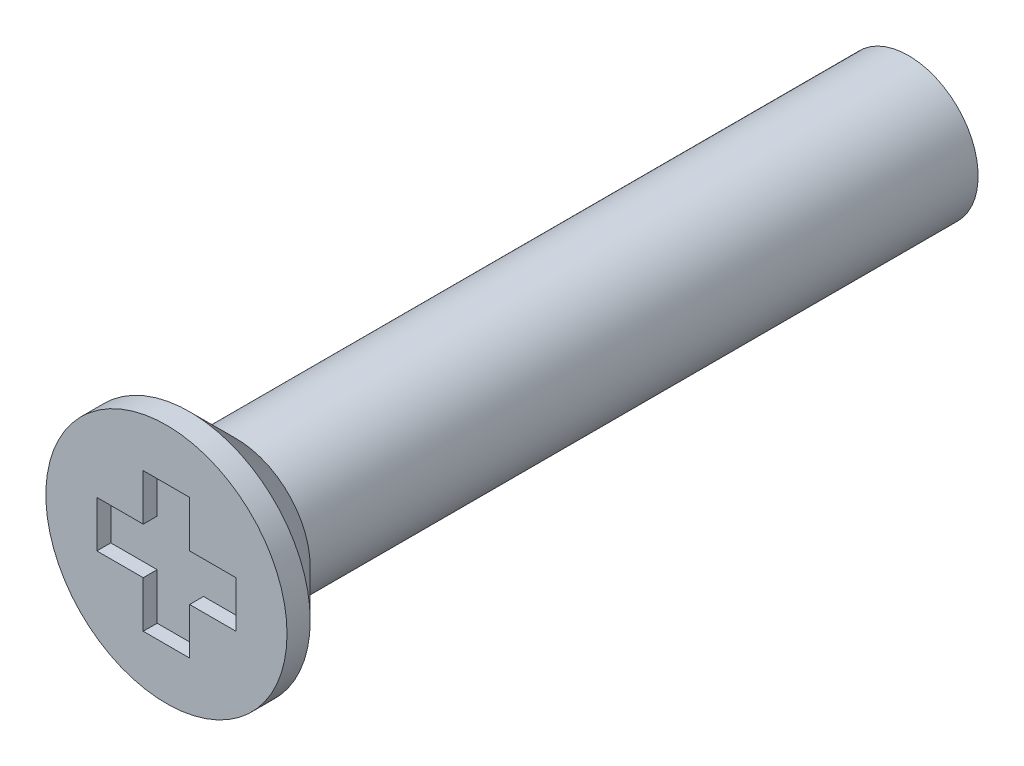
ISO-10303-21;
HEADER;
FILE_DESCRIPTION(('STEP AP214'),'2;1');
FILE_NAME('part.step','',(''),(''),'','','');
FILE_SCHEMA(('AUTOMOTIVE_DESIGN { 1 0 10303 214 1 1 1 1 }'));
ENDSEC;
DATA;
#1=APPLICATION_CONTEXT('core data for automotive mechanical design processes');
#2=APPLICATION_PROTOCOL_DEFINITION('international standard','automotive_design',2000,#1);
#3=PRODUCT_CONTEXT('',#1,'mechanical');
#4=PRODUCT('Part','Part','',(#3));
#5=PRODUCT_RELATED_PRODUCT_CATEGORY('part','',(#4));
#6=PRODUCT_DEFINITION_FORMATION('','',#4);
#7=PRODUCT_DEFINITION_CONTEXT('part definition',#1,'design');
#8=PRODUCT_DEFINITION('design','',#6,#7);
#9=PRODUCT_DEFINITION_SHAPE('','',#8);
#10=(LENGTH_UNIT() NAMED_UNIT(*) SI_UNIT(.MILLI.,.METRE.));
#11=(NAMED_UNIT(*) PLANE_ANGLE_UNIT() SI_UNIT($,.RADIAN.));
#12=(NAMED_UNIT(*) SI_UNIT($,.STERADIAN.) SOLID_ANGLE_UNIT());
#13=UNCERTAINTY_MEASURE_WITH_UNIT(LENGTH_MEASURE(1.E-05),#10,'distance_accuracy_value','');
#14=(GEOMETRIC_REPRESENTATION_CONTEXT(3) GLOBAL_UNCERTAINTY_ASSIGNED_CONTEXT((#13)) GLOBAL_UNIT_ASSIGNED_CONTEXT((#10,
#11,#12)) REPRESENTATION_CONTEXT('',''));
#15=CARTESIAN_POINT('',(0.,0.,0.));
#16=DIRECTION('',(0.,0.,1.));
#17=DIRECTION('',(1.,0.,0.));
#18=AXIS2_PLACEMENT_3D('',#15,#16,#17);
#19=CARTESIAN_POINT('',(0.,0.,10.));
#20=DIRECTION('',(0.,0.,1.));
#21=DIRECTION('',(1.,0.,0.));
#22=AXIS2_PLACEMENT_3D('',#19,#20,#21);
#23=PLANE('',#22);
#24=DIRECTION('',(0.,-1.,0.));
#25=VECTOR('',#24,1.);
#26=CARTESIAN_POINT('',(0.499999988824129,-0.249999994412065,10.));
#27=LINE('',#26,#25);
#28=CARTESIAN_POINT('',(0.499999988824129,-0.499999988824129,10.));
#29=VERTEX_POINT('',#28);
#30=CARTESIAN_POINT('',(0.499999988824129,-1.49999996647239,10.));
#31=VERTEX_POINT('',#30);
#32=EDGE_CURVE('E138',#29,#31,#27,.T.);
#33=ORIENTED_EDGE('',*,*,#32,.T.);
#34=DIRECTION('',(-1.,0.,0.));
#35=VECTOR('',#34,1.);
#36=CARTESIAN_POINT('',(0.249999994412065,-1.49999996647239,10.));
#37=LINE('',#36,#35);
#38=CARTESIAN_POINT('',(-0.499999988824129,-1.49999996647239,10.));
#39=VERTEX_POINT('',#38);
#40=EDGE_CURVE('E223',#31,#39,#37,.T.);
#41=ORIENTED_EDGE('',*,*,#40,.T.);
#42=DIRECTION('',(0.,1.,0.));
#43=VECTOR('',#42,1.);
#44=CARTESIAN_POINT('',(-0.499999988824129,-0.749999983236194,10.));
#45=LINE('',#44,#43);
#46=CARTESIAN_POINT('',(-0.499999988824129,-0.499999988824129,10.));
#47=VERTEX_POINT('',#46);
#48=EDGE_CURVE('E266',#39,#47,#45,.T.);
#49=ORIENTED_EDGE('',*,*,#48,.T.);
#50=DIRECTION('',(-1.,0.,0.));
#51=VECTOR('',#50,1.);
#52=CARTESIAN_POINT('',(-0.249999994412065,-0.499999988824129,10.));
#53=LINE('',#52,#51);
#54=CARTESIAN_POINT('',(-1.49999996647239,-0.499999988824129,10.));
#55=VERTEX_POINT('',#54);
#56=EDGE_CURVE('E161',#47,#55,#53,.T.);
#57=ORIENTED_EDGE('',*,*,#56,.T.);
#58=DIRECTION('',(0.,1.,0.));
#59=VECTOR('',#58,1.);
#60=CARTESIAN_POINT('',(-1.49999996647239,-0.249999994412065,10.));
#61=LINE('',#60,#59);
#62=CARTESIAN_POINT('',(-1.49999996647239,0.499999988824129,10.));
#63=VERTEX_POINT('',#62);
#64=EDGE_CURVE('E21',#55,#63,#61,.T.);
#65=ORIENTED_EDGE('',*,*,#64,.T.);
#66=DIRECTION('',(1.,0.,0.));
#67=VECTOR('',#66,1.);
#68=CARTESIAN_POINT('',(-0.749999983236194,0.499999988824129,10.));
#69=LINE('',#68,#67);
#70=CARTESIAN_POINT('',(-0.499999988824129,0.499999988824129,10.));
#71=VERTEX_POINT('',#70);
#72=EDGE_CURVE('E270',#63,#71,#69,.T.);
#73=ORIENTED_EDGE('',*,*,#72,.T.);
#74=DIRECTION('',(0.,1.,0.));
#75=VECTOR('',#74,1.);
#76=CARTESIAN_POINT('',(-0.499999988824129,0.249999994412065,10.));
#77=LINE('',#76,#75);
#78=CARTESIAN_POINT('',(-0.499999988824129,1.49999996647239,10.));
#79=VERTEX_POINT('',#78);
#80=EDGE_CURVE('E162',#71,#79,#77,.T.);
#81=ORIENTED_EDGE('',*,*,#80,.T.);
#82=DIRECTION('',(1.,0.,0.));
#83=VECTOR('',#82,1.);
#84=CARTESIAN_POINT('',(-0.249999994412065,1.49999996647239,10.));
#85=LINE('',#84,#83);
#86=CARTESIAN_POINT('',(0.499999988824129,1.49999996647239,10.));
#87=VERTEX_POINT('',#86);
#88=EDGE_CURVE('E222',#79,#87,#85,.T.);
#89=ORIENTED_EDGE('',*,*,#88,.T.);
#90=DIRECTION('',(0.,-1.,0.));
#91=VECTOR('',#90,1.);
#92=CARTESIAN_POINT('',(0.499999988824129,0.749999983236194,10.));
#93=LINE('',#92,#91);
#94=CARTESIAN_POINT('',(0.499999988824129,0.499999988824129,10.));
#95=VERTEX_POINT('',#94);
#96=EDGE_CURVE('E177',#87,#95,#93,.T.);
#97=ORIENTED_EDGE('',*,*,#96,.T.);
#98=DIRECTION('',(1.,0.,0.));
#99=VECTOR('',#98,1.);
#100=CARTESIAN_POINT('',(0.249999994412065,0.499999988824129,10.));
#101=LINE('',#100,#99);
#102=CARTESIAN_POINT('',(1.49999996647239,0.499999988824129,10.));
#103=VERTEX_POINT('',#102);
#104=EDGE_CURVE('E170',#95,#103,#101,.T.);
#105=ORIENTED_EDGE('',*,*,#104,.T.);
#106=DIRECTION('',(0.,-1.,0.));
#107=VECTOR('',#106,1.);
#108=CARTESIAN_POINT('',(1.49999996647239,0.249999994412065,10.));
#109=LINE('',#108,#107);
#110=CARTESIAN_POINT('',(1.49999996647239,-0.499999988824129,10.));
#111=VERTEX_POINT('',#110);
#112=EDGE_CURVE('E278',#103,#111,#109,.T.);
#113=ORIENTED_EDGE('',*,*,#112,.T.);
#114=DIRECTION('',(-1.,0.,0.));
#115=VECTOR('',#114,1.);
#116=CARTESIAN_POINT('',(0.749999983236194,-0.499999988824129,10.));
#117=LINE('',#116,#115);
#118=EDGE_CURVE('E178',#111,#29,#117,.T.);
#119=ORIENTED_EDGE('',*,*,#118,.T.);
#120=EDGE_LOOP('',(#33,#41,#49,#57,#65,#73,#81,#89,#97,#105,#113,#119));
#121=FACE_BOUND('',#120,.T.);
#122=CARTESIAN_POINT('',(0.,0.,10.));
#123=DIRECTION('',(0.,0.,1.));
#124=DIRECTION('',(-1.,0.,0.));
#125=AXIS2_PLACEMENT_3D('',#122,#123,#124);
#126=CIRCLE('',#125,2.6);
#127=CARTESIAN_POINT('',(2.6,0.,10.));
#128=VERTEX_POINT('',#127);
#129=EDGE_CURVE('E204',#128,#128,#126,.T.);
#130=ORIENTED_EDGE('',*,*,#129,.T.);
#131=EDGE_LOOP('',(#130));
#132=FACE_BOUND('',#131,.T.);
#133=ADVANCED_FACE('F17',(#121,#132),#23,.T.);
#134=CARTESIAN_POINT('',(0.,0.,0.));
#135=DIRECTION('',(0.,0.,1.));
#136=DIRECTION('',(1.,0.,0.));
#137=AXIS2_PLACEMENT_3D('',#134,#135,#136);
#138=CYLINDRICAL_SURFACE('',#137,1.5);
#139=CARTESIAN_POINT('',(0.,0.,8.5));
#140=DIRECTION('',(0.,0.,-1.));
#141=DIRECTION('',(1.,0.,0.));
#142=AXIS2_PLACEMENT_3D('',#139,#140,#141);
#143=CIRCLE('',#142,1.5);
#144=CARTESIAN_POINT('',(-1.5,0.,8.5));
#145=VERTEX_POINT('',#144);
#146=EDGE_CURVE('E28',#145,#145,#143,.T.);
#147=ORIENTED_EDGE('',*,*,#146,.T.);
#148=DIRECTION('',(0.,0.,-1.));
#149=VECTOR('',#148,1.);
#150=CARTESIAN_POINT('',(-1.5,0.,0.));
#151=LINE('',#150,#149);
#152=CARTESIAN_POINT('',(-1.5,0.,-6.));
#153=VERTEX_POINT('',#152);
#154=EDGE_CURVE('E11',#145,#153,#151,.T.);
#155=ORIENTED_EDGE('',*,*,#154,.T.);
#156=CARTESIAN_POINT('',(0.,0.,-6.));
#157=DIRECTION('',(0.,0.,-1.));
#158=DIRECTION('',(1.,0.,0.));
#159=AXIS2_PLACEMENT_3D('',#156,#157,#158);
#160=CIRCLE('',#159,1.5);
#161=EDGE_CURVE('E133',#153,#153,#160,.T.);
#162=ORIENTED_EDGE('',*,*,#161,.F.);
#163=ORIENTED_EDGE('',*,*,#154,.F.);
#164=EDGE_LOOP('',(#147,#155,#162,#163));
#165=FACE_BOUND('',#164,.T.);
#166=ADVANCED_FACE('F132',(#165),#138,.T.);
#167=CARTESIAN_POINT('',(0.,0.,8.5));
#168=DIRECTION('',(0.,0.,1.));
#169=DIRECTION('',(1.,0.,0.));
#170=AXIS2_PLACEMENT_3D('',#167,#168,#169);
#171=PLANE('',#170);
#172=ORIENTED_EDGE('',*,*,#146,.F.);
#173=EDGE_LOOP('',(#172));
#174=FACE_BOUND('',#173,.T.);
#175=CARTESIAN_POINT('',(0.,0.,8.5));
#176=DIRECTION('',(0.,0.,1.));
#177=DIRECTION('',(-1.,0.,0.));
#178=AXIS2_PLACEMENT_3D('',#175,#176,#177);
#179=CIRCLE('',#178,1.6);
#180=CARTESIAN_POINT('',(1.6,0.,8.5));
#181=VERTEX_POINT('',#180);
#182=EDGE_CURVE('E247',#181,#181,#179,.T.);
#183=ORIENTED_EDGE('',*,*,#182,.F.);
#184=EDGE_LOOP('',(#183));
#185=FACE_BOUND('',#184,.T.);
#186=ADVANCED_FACE('F368',(#174,#185),#171,.F.);
#187=CARTESIAN_POINT('',(0.,0.,10.));
#188=DIRECTION('',(0.,0.,-1.));
#189=DIRECTION('',(-1.,0.,0.));
#190=AXIS2_PLACEMENT_3D('',#187,#188,#189);
#191=CYLINDRICAL_SURFACE('',#190,2.6);
#192=CARTESIAN_POINT('',(0.,0.,9.5));
#193=DIRECTION('',(0.,0.,-1.));
#194=DIRECTION('',(-1.,0.,0.));
#195=AXIS2_PLACEMENT_3D('',#192,#193,#194);
#196=CIRCLE('',#195,2.6);
#197=CARTESIAN_POINT('',(2.6,0.,9.5));
#198=VERTEX_POINT('',#197);
#199=EDGE_CURVE('E255',#198,#198,#196,.T.);
#200=ORIENTED_EDGE('',*,*,#199,.F.);
#201=DIRECTION('',(0.,0.,1.));
#202=VECTOR('',#201,1.);
#203=CARTESIAN_POINT('',(2.6,0.,10.));
#204=LINE('',#203,#202);
#205=EDGE_CURVE('E259',#198,#128,#204,.T.);
#206=ORIENTED_EDGE('',*,*,#205,.T.);
#207=ORIENTED_EDGE('',*,*,#129,.F.);
#208=ORIENTED_EDGE('',*,*,#205,.F.);
#209=EDGE_LOOP('',(#200,#206,#207,#208));
#210=FACE_BOUND('',#209,.T.);
#211=ADVANCED_FACE('F363',(#210),#191,.T.);
#212=CARTESIAN_POINT('',(0.,0.,9.));
#213=DIRECTION('',(0.,0.,1.));
#214=DIRECTION('',(-1.,0.,0.));
#215=AXIS2_PLACEMENT_3D('',#212,#213,#214);
#216=CONICAL_SURFACE('',#215,2.1,0.785398163397448);
#217=ORIENTED_EDGE('',*,*,#182,.T.);
#218=DIRECTION('',(0.707106781186548,0.,0.707106781186547));
#219=VECTOR('',#218,1.);
#220=CARTESIAN_POINT('',(2.1,0.,9.));
#221=LINE('',#220,#219);
#222=EDGE_CURVE('E251',#181,#198,#221,.T.);
#223=ORIENTED_EDGE('',*,*,#222,.T.);
#224=ORIENTED_EDGE('',*,*,#199,.T.);
#225=ORIENTED_EDGE('',*,*,#222,.F.);
#226=EDGE_LOOP('',(#217,#223,#224,#225));
#227=FACE_BOUND('',#226,.T.);
#228=ADVANCED_FACE('F365',(#227),#216,.T.);
#229=CARTESIAN_POINT('',(0.,0.,9.7));
#230=DIRECTION('',(0.,0.,-1.));
#231=DIRECTION('',(0.,-1.,0.));
#232=AXIS2_PLACEMENT_3D('',#229,#230,#231);
#233=PLANE('',#232);
#234=DIRECTION('',(-1.,0.,0.));
#235=VECTOR('',#234,1.);
#236=CARTESIAN_POINT('',(0.499999988824129,-1.49999996647239,9.7));
#237=LINE('',#236,#235);
#238=CARTESIAN_POINT('',(0.499999988824129,-1.49999996647239,9.7));
#239=VERTEX_POINT('',#238);
#240=CARTESIAN_POINT('',(-0.499999988824129,-1.49999996647239,9.7));
#241=VERTEX_POINT('',#240);
#242=EDGE_CURVE('E225',#239,#241,#237,.T.);
#243=ORIENTED_EDGE('',*,*,#242,.F.);
#244=DIRECTION('',(0.,-1.,0.));
#245=VECTOR('',#244,1.);
#246=CARTESIAN_POINT('',(0.499999988824129,1.49999996647239,9.7));
#247=LINE('',#246,#245);
#248=CARTESIAN_POINT('',(0.499999988824129,-0.499999988824129,9.7));
#249=VERTEX_POINT('',#248);
#250=EDGE_CURVE('E210',#249,#239,#247,.T.);
#251=ORIENTED_EDGE('',*,*,#250,.F.);
#252=DIRECTION('',(-1.,0.,0.));
#253=VECTOR('',#252,1.);
#254=CARTESIAN_POINT('',(1.49999996647239,-0.499999988824129,9.7));
#255=LINE('',#254,#253);
#256=CARTESIAN_POINT('',(1.49999996647239,-0.499999988824129,9.7));
#257=VERTEX_POINT('',#256);
#258=EDGE_CURVE('E217',#257,#249,#255,.T.);
#259=ORIENTED_EDGE('',*,*,#258,.F.);
#260=DIRECTION('',(0.,-1.,0.));
#261=VECTOR('',#260,1.);
#262=CARTESIAN_POINT('',(1.49999996647239,0.499999988824129,9.7));
#263=LINE('',#262,#261);
#264=CARTESIAN_POINT('',(1.49999996647239,0.499999988824129,9.7));
#265=VERTEX_POINT('',#264);
#266=EDGE_CURVE('E167',#265,#257,#263,.T.);
#267=ORIENTED_EDGE('',*,*,#266,.F.);
#268=DIRECTION('',(1.,0.,0.));
#269=VECTOR('',#268,1.);
#270=CARTESIAN_POINT('',(-1.49999996647239,0.499999988824129,9.7));
#271=LINE('',#270,#269);
#272=CARTESIAN_POINT('',(0.499999988824129,0.499999988824129,9.7));
#273=VERTEX_POINT('',#272);
#274=EDGE_CURVE('E209',#273,#265,#271,.T.);
#275=ORIENTED_EDGE('',*,*,#274,.F.);
#276=DIRECTION('',(0.,-1.,0.));
#277=VECTOR('',#276,1.);
#278=CARTESIAN_POINT('',(0.499999988824129,1.49999996647239,9.7));
#279=LINE('',#278,#277);
#280=CARTESIAN_POINT('',(0.499999988824129,1.49999996647239,9.7));
#281=VERTEX_POINT('',#280);
#282=EDGE_CURVE('E176',#281,#273,#279,.T.);
#283=ORIENTED_EDGE('',*,*,#282,.F.);
#284=DIRECTION('',(1.,0.,0.));
#285=VECTOR('',#284,1.);
#286=CARTESIAN_POINT('',(-0.499999988824129,1.49999996647239,9.7));
#287=LINE('',#286,#285);
#288=CARTESIAN_POINT('',(-0.499999988824129,1.49999996647239,9.7));
#289=VERTEX_POINT('',#288);
#290=EDGE_CURVE('E166',#289,#281,#287,.T.);
#291=ORIENTED_EDGE('',*,*,#290,.F.);
#292=DIRECTION('',(0.,1.,0.));
#293=VECTOR('',#292,1.);
#294=CARTESIAN_POINT('',(-0.499999988824129,-1.49999996647239,9.7));
#295=LINE('',#294,#293);
#296=CARTESIAN_POINT('',(-0.499999988824129,0.499999988824129,9.7));
#297=VERTEX_POINT('',#296);
#298=EDGE_CURVE('E273',#297,#289,#295,.T.);
#299=ORIENTED_EDGE('',*,*,#298,.F.);
#300=DIRECTION('',(1.,0.,0.));
#301=VECTOR('',#300,1.);
#302=CARTESIAN_POINT('',(-1.49999996647239,0.499999988824129,9.7));
#303=LINE('',#302,#301);
#304=CARTESIAN_POINT('',(-1.49999996647239,0.499999988824129,9.7));
#305=VERTEX_POINT('',#304);
#306=EDGE_CURVE('E151',#305,#297,#303,.T.);
#307=ORIENTED_EDGE('',*,*,#306,.F.);
#308=DIRECTION('',(0.,1.,0.));
#309=VECTOR('',#308,1.);
#310=CARTESIAN_POINT('',(-1.49999996647239,-0.499999988824129,9.7));
#311=LINE('',#310,#309);
#312=CARTESIAN_POINT('',(-1.49999996647239,-0.499999988824129,9.7));
#313=VERTEX_POINT('',#312);
#314=EDGE_CURVE('E182',#313,#305,#311,.T.);
#315=ORIENTED_EDGE('',*,*,#314,.F.);
#316=DIRECTION('',(-1.,0.,0.));
#317=VECTOR('',#316,1.);
#318=CARTESIAN_POINT('',(1.49999996647239,-0.499999988824129,9.7));
#319=LINE('',#318,#317);
#320=CARTESIAN_POINT('',(-0.499999988824129,-0.499999988824129,9.7));
#321=VERTEX_POINT('',#320);
#322=EDGE_CURVE('E160',#321,#313,#319,.T.);
#323=ORIENTED_EDGE('',*,*,#322,.F.);
#324=DIRECTION('',(0.,1.,0.));
#325=VECTOR('',#324,1.);
#326=CARTESIAN_POINT('',(-0.499999988824129,-1.49999996647239,9.7));
#327=LINE('',#326,#325);
#328=EDGE_CURVE('E149',#241,#321,#327,.T.);
#329=ORIENTED_EDGE('',*,*,#328,.F.);
#330=EDGE_LOOP('',(#243,#251,#259,#267,#275,#283,#291,#299,#307,#315,#323,#329));
#331=FACE_BOUND('',#330,.T.);
#332=ADVANCED_FACE('F306',(#331),#233,.F.);
#333=CARTESIAN_POINT('',(0.499999988824129,-1.49999996647239,10.));
#334=DIRECTION('',(0.,-1.,0.));
#335=DIRECTION('',(0.,0.,-1.));
#336=AXIS2_PLACEMENT_3D('',#333,#334,#335);
#337=PLANE('',#336);
#338=ORIENTED_EDGE('',*,*,#40,.F.);
#339=DIRECTION('',(0.,0.,-1.));
#340=VECTOR('',#339,1.);
#341=CARTESIAN_POINT('',(0.499999988824129,-1.49999996647239,10.));
#342=LINE('',#341,#340);
#343=EDGE_CURVE('E181',#31,#239,#342,.T.);
#344=ORIENTED_EDGE('',*,*,#343,.T.);
#345=ORIENTED_EDGE('',*,*,#242,.T.);
#346=DIRECTION('',(0.,0.,-1.));
#347=VECTOR('',#346,1.);
#348=CARTESIAN_POINT('',(-0.499999988824129,-1.49999996647239,10.));
#349=LINE('',#348,#347);
#350=EDGE_CURVE('E269',#39,#241,#349,.T.);
#351=ORIENTED_EDGE('',*,*,#350,.F.);
#352=EDGE_LOOP('',(#338,#344,#345,#351));
#353=FACE_BOUND('',#352,.T.);
#354=ADVANCED_FACE('F410',(#353),#337,.F.);
#355=CARTESIAN_POINT('',(-0.499999988824129,-1.49999996647239,10.));
#356=DIRECTION('',(-1.,0.,0.));
#357=DIRECTION('',(0.,0.,1.));
#358=AXIS2_PLACEMENT_3D('',#355,#356,#357);
#359=PLANE('',#358);
#360=ORIENTED_EDGE('',*,*,#48,.F.);
#361=ORIENTED_EDGE('',*,*,#350,.T.);
#362=ORIENTED_EDGE('',*,*,#328,.T.);
#363=DIRECTION('',(0.,0.,-1.));
#364=VECTOR('',#363,1.);
#365=CARTESIAN_POINT('',(-0.499999988824129,-0.499999988824129,10.));
#366=LINE('',#365,#364);
#367=EDGE_CURVE('E156',#47,#321,#366,.T.);
#368=ORIENTED_EDGE('',*,*,#367,.F.);
#369=EDGE_LOOP('',(#360,#361,#362,#368));
#370=FACE_BOUND('',#369,.T.);
#371=ADVANCED_FACE('F412',(#370),#359,.F.);
#372=CARTESIAN_POINT('',(-0.499999988824129,-0.499999988824129,10.));
#373=DIRECTION('',(0.,-1.,0.));
#374=DIRECTION('',(0.,0.,-1.));
#375=AXIS2_PLACEMENT_3D('',#372,#373,#374);
#376=PLANE('',#375);
#377=ORIENTED_EDGE('',*,*,#56,.F.);
#378=ORIENTED_EDGE('',*,*,#367,.T.);
#379=ORIENTED_EDGE('',*,*,#322,.T.);
#380=DIRECTION('',(0.,0.,-1.));
#381=VECTOR('',#380,1.);
#382=CARTESIAN_POINT('',(-1.49999996647239,-0.499999988824129,10.));
#383=LINE('',#382,#381);
#384=EDGE_CURVE('E184',#55,#313,#383,.T.);
#385=ORIENTED_EDGE('',*,*,#384,.F.);
#386=EDGE_LOOP('',(#377,#378,#379,#385));
#387=FACE_BOUND('',#386,.T.);
#388=ADVANCED_FACE('F414',(#387),#376,.F.);
#389=CARTESIAN_POINT('',(-1.49999996647239,-0.499999988824129,10.));
#390=DIRECTION('',(-1.,0.,0.));
#391=DIRECTION('',(0.,0.,1.));
#392=AXIS2_PLACEMENT_3D('',#389,#390,#391);
#393=PLANE('',#392);
#394=ORIENTED_EDGE('',*,*,#64,.F.);
#395=ORIENTED_EDGE('',*,*,#384,.T.);
#396=ORIENTED_EDGE('',*,*,#314,.T.);
#397=DIRECTION('',(0.,0.,-1.));
#398=VECTOR('',#397,1.);
#399=CARTESIAN_POINT('',(-1.49999996647239,0.499999988824129,10.));
#400=LINE('',#399,#398);
#401=EDGE_CURVE('E155',#63,#305,#400,.T.);
#402=ORIENTED_EDGE('',*,*,#401,.F.);
#403=EDGE_LOOP('',(#394,#395,#396,#402));
#404=FACE_BOUND('',#403,.T.);
#405=ADVANCED_FACE('F415',(#404),#393,.F.);
#406=CARTESIAN_POINT('',(-1.49999996647239,0.499999988824129,10.));
#407=DIRECTION('',(0.,1.,0.));
#408=DIRECTION('',(1.,0.,0.));
#409=AXIS2_PLACEMENT_3D('',#406,#407,#408);
#410=PLANE('',#409);
#411=ORIENTED_EDGE('',*,*,#72,.F.);
#412=ORIENTED_EDGE('',*,*,#401,.T.);
#413=ORIENTED_EDGE('',*,*,#306,.T.);
#414=DIRECTION('',(0.,0.,-1.));
#415=VECTOR('',#414,1.);
#416=CARTESIAN_POINT('',(-0.499999988824129,0.499999988824129,10.));
#417=LINE('',#416,#415);
#418=EDGE_CURVE('E165',#71,#297,#417,.T.);
#419=ORIENTED_EDGE('',*,*,#418,.F.);
#420=EDGE_LOOP('',(#411,#412,#413,#419));
#421=FACE_BOUND('',#420,.T.);
#422=ADVANCED_FACE('F19',(#421),#410,.F.);
#423=CARTESIAN_POINT('',(-0.499999988824129,0.499999988824129,10.));
#424=DIRECTION('',(-1.,0.,0.));
#425=DIRECTION('',(0.,0.,1.));
#426=AXIS2_PLACEMENT_3D('',#423,#424,#425);
#427=PLANE('',#426);
#428=ORIENTED_EDGE('',*,*,#80,.F.);
#429=ORIENTED_EDGE('',*,*,#418,.T.);
#430=ORIENTED_EDGE('',*,*,#298,.T.);
#431=DIRECTION('',(0.,0.,-1.));
#432=VECTOR('',#431,1.);
#433=CARTESIAN_POINT('',(-0.499999988824129,1.49999996647239,10.));
#434=LINE('',#433,#432);
#435=EDGE_CURVE('E218',#79,#289,#434,.T.);
#436=ORIENTED_EDGE('',*,*,#435,.F.);
#437=EDGE_LOOP('',(#428,#429,#430,#436));
#438=FACE_BOUND('',#437,.T.);
#439=ADVANCED_FACE('F299',(#438),#427,.F.);
#440=CARTESIAN_POINT('',(-0.499999988824129,1.49999996647239,10.));
#441=DIRECTION('',(0.,1.,0.));
#442=DIRECTION('',(1.,0.,0.));
#443=AXIS2_PLACEMENT_3D('',#440,#441,#442);
#444=PLANE('',#443);
#445=ORIENTED_EDGE('',*,*,#88,.F.);
#446=ORIENTED_EDGE('',*,*,#435,.T.);
#447=ORIENTED_EDGE('',*,*,#290,.T.);
#448=DIRECTION('',(0.,0.,-1.));
#449=VECTOR('',#448,1.);
#450=CARTESIAN_POINT('',(0.499999988824129,1.49999996647239,10.));
#451=LINE('',#450,#449);
#452=EDGE_CURVE('E172',#87,#281,#451,.T.);
#453=ORIENTED_EDGE('',*,*,#452,.F.);
#454=EDGE_LOOP('',(#445,#446,#447,#453));
#455=FACE_BOUND('',#454,.T.);
#456=ADVANCED_FACE('F311',(#455),#444,.F.);
#457=CARTESIAN_POINT('',(0.499999988824129,1.49999996647239,10.));
#458=DIRECTION('',(1.,0.,0.));
#459=DIRECTION('',(0.,1.,0.));
#460=AXIS2_PLACEMENT_3D('',#457,#458,#459);
#461=PLANE('',#460);
#462=ORIENTED_EDGE('',*,*,#96,.F.);
#463=ORIENTED_EDGE('',*,*,#452,.T.);
#464=ORIENTED_EDGE('',*,*,#282,.T.);
#465=DIRECTION('',(0.,0.,-1.));
#466=VECTOR('',#465,1.);
#467=CARTESIAN_POINT('',(0.499999988824129,0.499999988824129,10.));
#468=LINE('',#467,#466);
#469=EDGE_CURVE('E228',#95,#273,#468,.T.);
#470=ORIENTED_EDGE('',*,*,#469,.F.);
#471=EDGE_LOOP('',(#462,#463,#464,#470));
#472=FACE_BOUND('',#471,.T.);
#473=ADVANCED_FACE('F336',(#472),#461,.F.);
#474=CARTESIAN_POINT('',(0.499999988824129,0.499999988824129,10.));
#475=DIRECTION('',(0.,1.,0.));
#476=DIRECTION('',(1.,0.,0.));
#477=AXIS2_PLACEMENT_3D('',#474,#475,#476);
#478=PLANE('',#477);
#479=ORIENTED_EDGE('',*,*,#104,.F.);
#480=ORIENTED_EDGE('',*,*,#469,.T.);
#481=ORIENTED_EDGE('',*,*,#274,.T.);
#482=DIRECTION('',(0.,0.,-1.));
#483=VECTOR('',#482,1.);
#484=CARTESIAN_POINT('',(1.49999996647239,0.499999988824129,10.));
#485=LINE('',#484,#483);
#486=EDGE_CURVE('E171',#103,#265,#485,.T.);
#487=ORIENTED_EDGE('',*,*,#486,.F.);
#488=EDGE_LOOP('',(#479,#480,#481,#487));
#489=FACE_BOUND('',#488,.T.);
#490=ADVANCED_FACE('F389',(#489),#478,.F.);
#491=CARTESIAN_POINT('',(1.49999996647239,0.499999988824129,10.));
#492=DIRECTION('',(1.,0.,0.));
#493=DIRECTION('',(0.,1.,0.));
#494=AXIS2_PLACEMENT_3D('',#491,#492,#493);
#495=PLANE('',#494);
#496=ORIENTED_EDGE('',*,*,#112,.F.);
#497=ORIENTED_EDGE('',*,*,#486,.T.);
#498=ORIENTED_EDGE('',*,*,#266,.T.);
#499=DIRECTION('',(0.,0.,-1.));
#500=VECTOR('',#499,1.);
#501=CARTESIAN_POINT('',(1.49999996647239,-0.499999988824129,10.));
#502=LINE('',#501,#500);
#503=EDGE_CURVE('E180',#111,#257,#502,.T.);
#504=ORIENTED_EDGE('',*,*,#503,.F.);
#505=EDGE_LOOP('',(#496,#497,#498,#504));
#506=FACE_BOUND('',#505,.T.);
#507=ADVANCED_FACE('F343',(#506),#495,.F.);
#508=CARTESIAN_POINT('',(1.49999996647239,-0.499999988824129,10.));
#509=DIRECTION('',(0.,-1.,0.));
#510=DIRECTION('',(0.,0.,-1.));
#511=AXIS2_PLACEMENT_3D('',#508,#509,#510);
#512=PLANE('',#511);
#513=ORIENTED_EDGE('',*,*,#118,.F.);
#514=ORIENTED_EDGE('',*,*,#503,.T.);
#515=ORIENTED_EDGE('',*,*,#258,.T.);
#516=DIRECTION('',(0.,0.,-1.));
#517=VECTOR('',#516,1.);
#518=CARTESIAN_POINT('',(0.499999988824129,-0.499999988824129,10.));
#519=LINE('',#518,#517);
#520=EDGE_CURVE('E145',#29,#249,#519,.T.);
#521=ORIENTED_EDGE('',*,*,#520,.F.);
#522=EDGE_LOOP('',(#513,#514,#515,#521));
#523=FACE_BOUND('',#522,.T.);
#524=ADVANCED_FACE('F396',(#523),#512,.F.);
#525=CARTESIAN_POINT('',(0.499999988824129,-0.499999988824129,10.));
#526=DIRECTION('',(1.,0.,0.));
#527=DIRECTION('',(0.,1.,0.));
#528=AXIS2_PLACEMENT_3D('',#525,#526,#527);
#529=PLANE('',#528);
#530=ORIENTED_EDGE('',*,*,#32,.F.);
#531=ORIENTED_EDGE('',*,*,#520,.T.);
#532=ORIENTED_EDGE('',*,*,#250,.T.);
#533=ORIENTED_EDGE('',*,*,#343,.F.);
#534=EDGE_LOOP('',(#530,#531,#532,#533));
#535=FACE_BOUND('',#534,.T.);
#536=ADVANCED_FACE('F405',(#535),#529,.F.);
#537=CARTESIAN_POINT('',(0.,0.,-6.));
#538=DIRECTION('',(0.,0.,1.));
#539=DIRECTION('',(1.,0.,0.));
#540=AXIS2_PLACEMENT_3D('',#537,#538,#539);
#541=PLANE('',#540);
#542=ORIENTED_EDGE('',*,*,#161,.T.);
#543=EDGE_LOOP('',(#542));
#544=FACE_BOUND('',#543,.T.);
#545=ADVANCED_FACE('F136',(#544),#541,.F.);
#546=CLOSED_SHELL('',(#133,#166,#186,#211,#228,#332,#354,#371,#388,#405,#422,#439,#456,#473,
#490,#507,#524,#536,#545));
#547=MANIFOLD_SOLID_BREP('B1',#546);
#548=ADVANCED_BREP_SHAPE_REPRESENTATION('',(#18,#547),#14);
#549=SHAPE_DEFINITION_REPRESENTATION(#9,#548);
ENDSEC;
END-ISO-10303-21;
